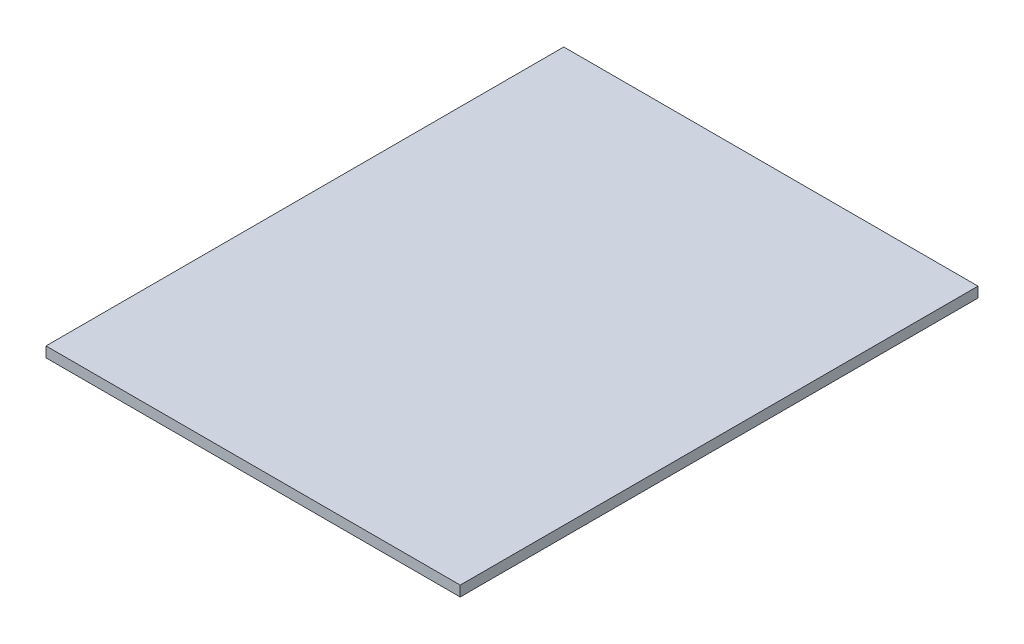
ISO-10303-21;
HEADER;
FILE_DESCRIPTION(('STEP AP214'),'2;1');
FILE_NAME('part.step','',(''),(''),'','','');
FILE_SCHEMA(('AUTOMOTIVE_DESIGN { 1 0 10303 214 1 1 1 1 }'));
ENDSEC;
DATA;
#1=APPLICATION_CONTEXT('core data for automotive mechanical design processes');
#2=APPLICATION_PROTOCOL_DEFINITION('international standard','automotive_design',2000,#1);
#3=PRODUCT_CONTEXT('',#1,'mechanical');
#4=PRODUCT('Part','Part','',(#3));
#5=PRODUCT_RELATED_PRODUCT_CATEGORY('part','',(#4));
#6=PRODUCT_DEFINITION_FORMATION('','',#4);
#7=PRODUCT_DEFINITION_CONTEXT('part definition',#1,'design');
#8=PRODUCT_DEFINITION('design','',#6,#7);
#9=PRODUCT_DEFINITION_SHAPE('','',#8);
#10=(LENGTH_UNIT() NAMED_UNIT(*) SI_UNIT(.MILLI.,.METRE.));
#11=(NAMED_UNIT(*) PLANE_ANGLE_UNIT() SI_UNIT($,.RADIAN.));
#12=(NAMED_UNIT(*) SI_UNIT($,.STERADIAN.) SOLID_ANGLE_UNIT());
#13=UNCERTAINTY_MEASURE_WITH_UNIT(LENGTH_MEASURE(1.E-05),#10,'distance_accuracy_value','');
#14=(GEOMETRIC_REPRESENTATION_CONTEXT(3) GLOBAL_UNCERTAINTY_ASSIGNED_CONTEXT((#13)) GLOBAL_UNIT_ASSIGNED_CONTEXT((#10,
#11,#12)) REPRESENTATION_CONTEXT('',''));
#15=CARTESIAN_POINT('',(0.,0.,0.));
#16=DIRECTION('',(0.,0.,1.));
#17=DIRECTION('',(1.,0.,0.));
#18=AXIS2_PLACEMENT_3D('',#15,#16,#17);
#19=CARTESIAN_POINT('',(10302.4426454466,5.,3358.54786986152));
#20=DIRECTION('',(1.,0.,0.));
#21=DIRECTION('',(0.,0.,-1.));
#22=AXIS2_PLACEMENT_3D('',#19,#20,#21);
#23=PLANE('',#22);
#24=DIRECTION('',(0.,0.,1.));
#25=VECTOR('',#24,1.);
#26=CARTESIAN_POINT('',(10302.4426454466,0.,3358.54786986152));
#27=LINE('',#26,#25);
#28=CARTESIAN_POINT('',(10302.4426454466,0.,3358.54786986152));
#29=VERTEX_POINT('',#28);
#30=CARTESIAN_POINT('',(10302.4426454466,0.,3608.54786986152));
#31=VERTEX_POINT('',#30);
#32=EDGE_CURVE('E95',#29,#31,#27,.T.);
#33=ORIENTED_EDGE('',*,*,#32,.T.);
#34=DIRECTION('',(0.,-1.,0.));
#35=VECTOR('',#34,1.);
#36=CARTESIAN_POINT('',(10302.4426454466,5.,3608.54786986152));
#37=LINE('',#36,#35);
#38=CARTESIAN_POINT('',(10302.4426454466,5.,3608.54786986152));
#39=VERTEX_POINT('',#38);
#40=EDGE_CURVE('E11',#39,#31,#37,.T.);
#41=ORIENTED_EDGE('',*,*,#40,.F.);
#42=DIRECTION('',(0.,0.,1.));
#43=VECTOR('',#42,1.);
#44=CARTESIAN_POINT('',(10302.4426454466,5.,3358.54786986152));
#45=LINE('',#44,#43);
#46=CARTESIAN_POINT('',(10302.4426454466,5.,3358.54786986152));
#47=VERTEX_POINT('',#46);
#48=EDGE_CURVE('E83',#47,#39,#45,.T.);
#49=ORIENTED_EDGE('',*,*,#48,.F.);
#50=DIRECTION('',(0.,-1.,0.));
#51=VECTOR('',#50,1.);
#52=CARTESIAN_POINT('',(10302.4426454466,5.,3358.54786986152));
#53=LINE('',#52,#51);
#54=EDGE_CURVE('E91',#47,#29,#53,.T.);
#55=ORIENTED_EDGE('',*,*,#54,.T.);
#56=EDGE_LOOP('',(#33,#41,#49,#55));
#57=FACE_BOUND('',#56,.T.);
#58=ADVANCED_FACE('F32',(#57),#23,.F.);
#59=CARTESIAN_POINT('',(10302.4426454466,5.,3608.54786986152));
#60=DIRECTION('',(0.,0.,-1.));
#61=DIRECTION('',(-1.,0.,0.));
#62=AXIS2_PLACEMENT_3D('',#59,#60,#61);
#63=PLANE('',#62);
#64=DIRECTION('',(1.,0.,0.));
#65=VECTOR('',#64,1.);
#66=CARTESIAN_POINT('',(10302.4426454466,0.,3608.54786986152));
#67=LINE('',#66,#65);
#68=CARTESIAN_POINT('',(10502.4426454466,0.,3608.54786986152));
#69=VERTEX_POINT('',#68);
#70=EDGE_CURVE('E87',#31,#69,#67,.T.);
#71=ORIENTED_EDGE('',*,*,#70,.T.);
#72=DIRECTION('',(0.,-1.,0.));
#73=VECTOR('',#72,1.);
#74=CARTESIAN_POINT('',(10502.4426454466,5.,3608.54786986152));
#75=LINE('',#74,#73);
#76=CARTESIAN_POINT('',(10502.4426454466,5.,3608.54786986152));
#77=VERTEX_POINT('',#76);
#78=EDGE_CURVE('E40',#77,#69,#75,.T.);
#79=ORIENTED_EDGE('',*,*,#78,.F.);
#80=DIRECTION('',(1.,0.,0.));
#81=VECTOR('',#80,1.);
#82=CARTESIAN_POINT('',(10302.4426454466,5.,3608.54786986152));
#83=LINE('',#82,#81);
#84=EDGE_CURVE('E78',#39,#77,#83,.T.);
#85=ORIENTED_EDGE('',*,*,#84,.F.);
#86=ORIENTED_EDGE('',*,*,#40,.T.);
#87=EDGE_LOOP('',(#71,#79,#85,#86));
#88=FACE_BOUND('',#87,.T.);
#89=ADVANCED_FACE('F86',(#88),#63,.F.);
#90=CARTESIAN_POINT('',(10502.4426454466,5.,3358.54786986152));
#91=DIRECTION('',(-1.,0.,0.));
#92=DIRECTION('',(0.,0.,1.));
#93=AXIS2_PLACEMENT_3D('',#90,#91,#92);
#94=PLANE('',#93);
#95=DIRECTION('',(0.,0.,-1.));
#96=VECTOR('',#95,1.);
#97=CARTESIAN_POINT('',(10502.4426454466,0.,3358.54786986152));
#98=LINE('',#97,#96);
#99=CARTESIAN_POINT('',(10502.4426454466,0.,3358.54786986152));
#100=VERTEX_POINT('',#99);
#101=EDGE_CURVE('E65',#69,#100,#98,.T.);
#102=ORIENTED_EDGE('',*,*,#101,.T.);
#103=DIRECTION('',(0.,-1.,0.));
#104=VECTOR('',#103,1.);
#105=CARTESIAN_POINT('',(10502.4426454466,5.,3358.54786986152));
#106=LINE('',#105,#104);
#107=CARTESIAN_POINT('',(10502.4426454466,5.,3358.54786986152));
#108=VERTEX_POINT('',#107);
#109=EDGE_CURVE('E88',#108,#100,#106,.T.);
#110=ORIENTED_EDGE('',*,*,#109,.F.);
#111=DIRECTION('',(0.,0.,-1.));
#112=VECTOR('',#111,1.);
#113=CARTESIAN_POINT('',(10502.4426454466,5.,3358.54786986152));
#114=LINE('',#113,#112);
#115=EDGE_CURVE('E81',#77,#108,#114,.T.);
#116=ORIENTED_EDGE('',*,*,#115,.F.);
#117=ORIENTED_EDGE('',*,*,#78,.T.);
#118=EDGE_LOOP('',(#102,#110,#116,#117));
#119=FACE_BOUND('',#118,.T.);
#120=ADVANCED_FACE('F89',(#119),#94,.F.);
#121=CARTESIAN_POINT('',(10302.4426454466,5.,3358.54786986152));
#122=DIRECTION('',(0.,0.,1.));
#123=DIRECTION('',(1.,0.,0.));
#124=AXIS2_PLACEMENT_3D('',#121,#122,#123);
#125=PLANE('',#124);
#126=DIRECTION('',(-1.,0.,0.));
#127=VECTOR('',#126,1.);
#128=CARTESIAN_POINT('',(10302.4426454466,0.,3358.54786986152));
#129=LINE('',#128,#127);
#130=EDGE_CURVE('E71',#100,#29,#129,.T.);
#131=ORIENTED_EDGE('',*,*,#130,.T.);
#132=ORIENTED_EDGE('',*,*,#54,.F.);
#133=DIRECTION('',(-1.,0.,0.));
#134=VECTOR('',#133,1.);
#135=CARTESIAN_POINT('',(10302.4426454466,5.,3358.54786986152));
#136=LINE('',#135,#134);
#137=EDGE_CURVE('E48',#108,#47,#136,.T.);
#138=ORIENTED_EDGE('',*,*,#137,.F.);
#139=ORIENTED_EDGE('',*,*,#109,.T.);
#140=EDGE_LOOP('',(#131,#132,#138,#139));
#141=FACE_BOUND('',#140,.T.);
#142=ADVANCED_FACE('F102',(#141),#125,.F.);
#143=CARTESIAN_POINT('',(0.,5.,0.));
#144=DIRECTION('',(0.,1.,0.));
#145=DIRECTION('',(0.,0.,1.));
#146=AXIS2_PLACEMENT_3D('',#143,#144,#145);
#147=PLANE('',#146);
#148=ORIENTED_EDGE('',*,*,#48,.T.);
#149=ORIENTED_EDGE('',*,*,#84,.T.);
#150=ORIENTED_EDGE('',*,*,#115,.T.);
#151=ORIENTED_EDGE('',*,*,#137,.T.);
#152=EDGE_LOOP('',(#148,#149,#150,#151));
#153=FACE_BOUND('',#152,.T.);
#154=ADVANCED_FACE('F79',(#153),#147,.T.);
#155=CARTESIAN_POINT('',(0.,0.,0.));
#156=DIRECTION('',(0.,1.,0.));
#157=DIRECTION('',(0.,0.,1.));
#158=AXIS2_PLACEMENT_3D('',#155,#156,#157);
#159=PLANE('',#158);
#160=ORIENTED_EDGE('',*,*,#32,.F.);
#161=ORIENTED_EDGE('',*,*,#130,.F.);
#162=ORIENTED_EDGE('',*,*,#101,.F.);
#163=ORIENTED_EDGE('',*,*,#70,.F.);
#164=EDGE_LOOP('',(#160,#161,#162,#163));
#165=FACE_BOUND('',#164,.T.);
#166=ADVANCED_FACE('F105',(#165),#159,.F.);
#167=CLOSED_SHELL('',(#58,#89,#120,#142,#154,#166));
#168=MANIFOLD_SOLID_BREP('B2',#167);
#169=ADVANCED_BREP_SHAPE_REPRESENTATION('',(#18,#168),#14);
#170=SHAPE_DEFINITION_REPRESENTATION(#9,#169);
ENDSEC;
END-ISO-10303-21;
